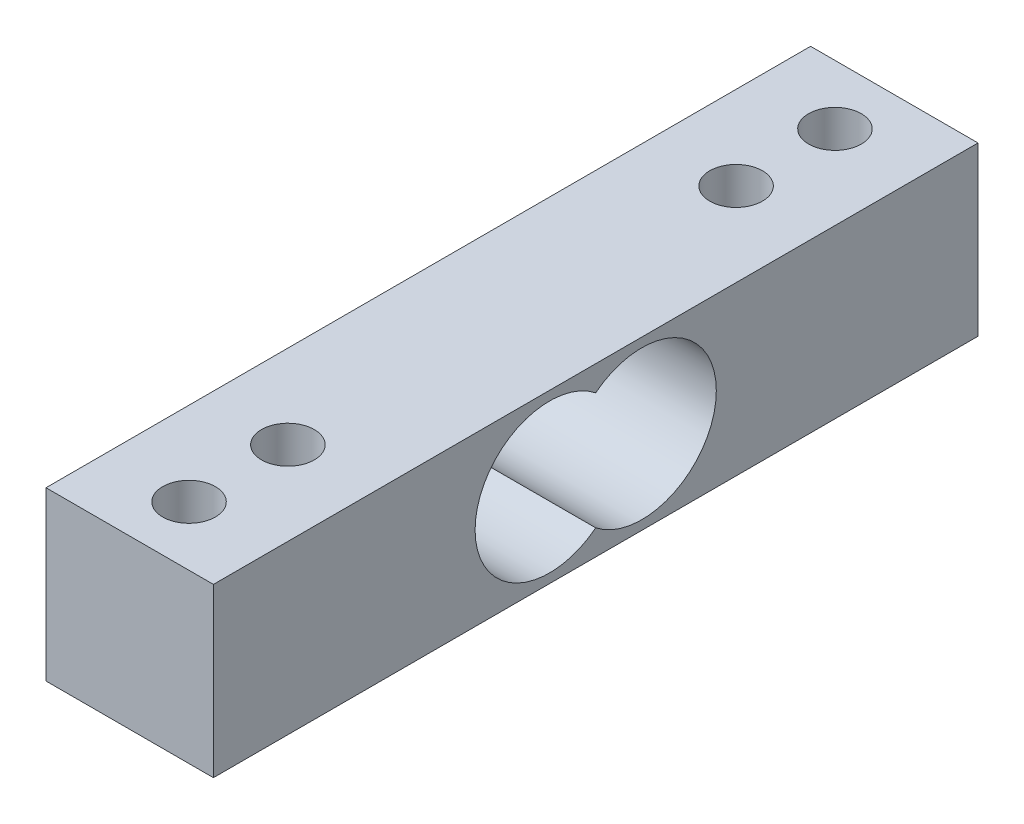
ISO-10303-21;
HEADER;
FILE_DESCRIPTION(('STEP AP214'),'2;1');
FILE_NAME('part.step','',(''),(''),'','','');
FILE_SCHEMA(('AUTOMOTIVE_DESIGN { 1 0 10303 214 1 1 1 1 }'));
ENDSEC;
DATA;
#1=APPLICATION_CONTEXT('core data for automotive mechanical design processes');
#2=APPLICATION_PROTOCOL_DEFINITION('international standard','automotive_design',2000,#1);
#3=PRODUCT_CONTEXT('',#1,'mechanical');
#4=PRODUCT('Part','Part','',(#3));
#5=PRODUCT_RELATED_PRODUCT_CATEGORY('part','',(#4));
#6=PRODUCT_DEFINITION_FORMATION('','',#4);
#7=PRODUCT_DEFINITION_CONTEXT('part definition',#1,'design');
#8=PRODUCT_DEFINITION('design','',#6,#7);
#9=PRODUCT_DEFINITION_SHAPE('','',#8);
#10=(LENGTH_UNIT() NAMED_UNIT(*) SI_UNIT(.MILLI.,.METRE.));
#11=(NAMED_UNIT(*) PLANE_ANGLE_UNIT() SI_UNIT($,.RADIAN.));
#12=(NAMED_UNIT(*) SI_UNIT($,.STERADIAN.) SOLID_ANGLE_UNIT());
#13=UNCERTAINTY_MEASURE_WITH_UNIT(LENGTH_MEASURE(1.E-05),#10,'distance_accuracy_value','');
#14=(GEOMETRIC_REPRESENTATION_CONTEXT(3) GLOBAL_UNCERTAINTY_ASSIGNED_CONTEXT((#13)) GLOBAL_UNIT_ASSIGNED_CONTEXT((#10,
#11,#12)) REPRESENTATION_CONTEXT('',''));
#15=CARTESIAN_POINT('',(0.,0.,0.));
#16=DIRECTION('',(0.,0.,1.));
#17=DIRECTION('',(1.,0.,0.));
#18=AXIS2_PLACEMENT_3D('',#15,#16,#17);
#19=CARTESIAN_POINT('',(-6.35,6.35,-29.));
#20=DIRECTION('',(-1.,0.,0.));
#21=DIRECTION('',(0.,-1.,0.));
#22=AXIS2_PLACEMENT_3D('',#19,#20,#21);
#23=PLANE('',#22);
#24=CARTESIAN_POINT('',(-6.35,0.,-3.5));
#25=DIRECTION('',(1.,0.,0.));
#26=DIRECTION('',(0.,0.,-1.));
#27=AXIS2_PLACEMENT_3D('',#24,#25,#26);
#28=CIRCLE('',#27,5.65);
#29=CARTESIAN_POINT('',(-6.34999999999999,-4.43536920672902,0.));
#30=VERTEX_POINT('',#29);
#31=CARTESIAN_POINT('',(-6.35,4.43536920672902,0.));
#32=VERTEX_POINT('',#31);
#33=EDGE_CURVE('E48',#30,#32,#28,.T.);
#34=ORIENTED_EDGE('',*,*,#33,.T.);
#35=CARTESIAN_POINT('',(-6.35,0.,3.5));
#36=DIRECTION('',(1.,0.,0.));
#37=DIRECTION('',(0.,0.,-1.));
#38=AXIS2_PLACEMENT_3D('',#35,#36,#37);
#39=CIRCLE('',#38,5.65);
#40=EDGE_CURVE('E88',#32,#30,#39,.T.);
#41=ORIENTED_EDGE('',*,*,#40,.T.);
#42=EDGE_LOOP('',(#34,#41));
#43=FACE_BOUND('',#42,.T.);
#44=DIRECTION('',(0.,-1.,0.));
#45=VECTOR('',#44,1.);
#46=CARTESIAN_POINT('',(-6.35,6.35,29.));
#47=LINE('',#46,#45);
#48=CARTESIAN_POINT('',(-6.35,6.35,29.));
#49=VERTEX_POINT('',#48);
#50=CARTESIAN_POINT('',(-6.34999999999999,-6.35,29.));
#51=VERTEX_POINT('',#50);
#52=EDGE_CURVE('E123',#49,#51,#47,.T.);
#53=ORIENTED_EDGE('',*,*,#52,.F.);
#54=DIRECTION('',(0.,0.,1.));
#55=VECTOR('',#54,1.);
#56=CARTESIAN_POINT('',(-6.35,6.35,-29.));
#57=LINE('',#56,#55);
#58=CARTESIAN_POINT('',(-6.35,6.35,-29.));
#59=VERTEX_POINT('',#58);
#60=EDGE_CURVE('E11',#59,#49,#57,.T.);
#61=ORIENTED_EDGE('',*,*,#60,.F.);
#62=DIRECTION('',(0.,-1.,0.));
#63=VECTOR('',#62,1.);
#64=CARTESIAN_POINT('',(-6.35,6.35,-29.));
#65=LINE('',#64,#63);
#66=CARTESIAN_POINT('',(-6.34999999999999,-6.35,-29.));
#67=VERTEX_POINT('',#66);
#68=EDGE_CURVE('E126',#59,#67,#65,.T.);
#69=ORIENTED_EDGE('',*,*,#68,.T.);
#70=DIRECTION('',(0.,0.,1.));
#71=VECTOR('',#70,1.);
#72=CARTESIAN_POINT('',(-6.34999999999999,-6.35,-29.));
#73=LINE('',#72,#71);
#74=EDGE_CURVE('E35',#67,#51,#73,.T.);
#75=ORIENTED_EDGE('',*,*,#74,.T.);
#76=EDGE_LOOP('',(#53,#61,#69,#75));
#77=FACE_BOUND('',#76,.T.);
#78=ADVANCED_FACE('F32',(#43,#77),#23,.T.);
#79=CARTESIAN_POINT('',(-6.35,6.35,-29.));
#80=DIRECTION('',(0.,1.,0.));
#81=DIRECTION('',(-1.,0.,0.));
#82=AXIS2_PLACEMENT_3D('',#79,#80,#81);
#83=PLANE('',#82);
#84=CARTESIAN_POINT('',(0.,6.35,24.5));
#85=DIRECTION('',(0.,1.,0.));
#86=DIRECTION('',(-1.,0.,0.));
#87=AXIS2_PLACEMENT_3D('',#84,#85,#86);
#88=CIRCLE('',#87,2.);
#89=CARTESIAN_POINT('',(-2.,6.35,24.5));
#90=VERTEX_POINT('',#89);
#91=EDGE_CURVE('E100',#90,#90,#88,.T.);
#92=ORIENTED_EDGE('',*,*,#91,.F.);
#93=EDGE_LOOP('',(#92));
#94=FACE_BOUND('',#93,.T.);
#95=CARTESIAN_POINT('',(0.,6.35,17.));
#96=DIRECTION('',(0.,1.,0.));
#97=DIRECTION('',(-1.,0.,0.));
#98=AXIS2_PLACEMENT_3D('',#95,#96,#97);
#99=CIRCLE('',#98,2.);
#100=CARTESIAN_POINT('',(-2.,6.35,17.));
#101=VERTEX_POINT('',#100);
#102=EDGE_CURVE('E105',#101,#101,#99,.T.);
#103=ORIENTED_EDGE('',*,*,#102,.F.);
#104=EDGE_LOOP('',(#103));
#105=FACE_BOUND('',#104,.T.);
#106=CARTESIAN_POINT('',(0.,6.35,-17.));
#107=DIRECTION('',(0.,1.,0.));
#108=DIRECTION('',(-1.,0.,0.));
#109=AXIS2_PLACEMENT_3D('',#106,#107,#108);
#110=CIRCLE('',#109,2.);
#111=CARTESIAN_POINT('',(-2.,6.35,-17.));
#112=VERTEX_POINT('',#111);
#113=EDGE_CURVE('E111',#112,#112,#110,.T.);
#114=ORIENTED_EDGE('',*,*,#113,.F.);
#115=EDGE_LOOP('',(#114));
#116=FACE_BOUND('',#115,.T.);
#117=CARTESIAN_POINT('',(0.,6.35,-24.5));
#118=DIRECTION('',(0.,1.,0.));
#119=DIRECTION('',(-1.,0.,0.));
#120=AXIS2_PLACEMENT_3D('',#117,#118,#119);
#121=CIRCLE('',#120,2.);
#122=CARTESIAN_POINT('',(-2.,6.35,-24.5));
#123=VERTEX_POINT('',#122);
#124=EDGE_CURVE('E117',#123,#123,#121,.T.);
#125=ORIENTED_EDGE('',*,*,#124,.F.);
#126=EDGE_LOOP('',(#125));
#127=FACE_BOUND('',#126,.T.);
#128=DIRECTION('',(-1.,0.,0.));
#129=VECTOR('',#128,1.);
#130=CARTESIAN_POINT('',(-6.35,6.35,29.));
#131=LINE('',#130,#129);
#132=CARTESIAN_POINT('',(6.35,6.35,29.));
#133=VERTEX_POINT('',#132);
#134=EDGE_CURVE('E130',#133,#49,#131,.T.);
#135=ORIENTED_EDGE('',*,*,#134,.F.);
#136=DIRECTION('',(0.,0.,1.));
#137=VECTOR('',#136,1.);
#138=CARTESIAN_POINT('',(6.35,6.35,-29.));
#139=LINE('',#138,#137);
#140=CARTESIAN_POINT('',(6.35,6.35,-29.));
#141=VERTEX_POINT('',#140);
#142=EDGE_CURVE('E40',#141,#133,#139,.T.);
#143=ORIENTED_EDGE('',*,*,#142,.F.);
#144=DIRECTION('',(-1.,0.,0.));
#145=VECTOR('',#144,1.);
#146=CARTESIAN_POINT('',(-6.35,6.35,-29.));
#147=LINE('',#146,#145);
#148=EDGE_CURVE('E136',#141,#59,#147,.T.);
#149=ORIENTED_EDGE('',*,*,#148,.T.);
#150=ORIENTED_EDGE('',*,*,#60,.T.);
#151=EDGE_LOOP('',(#135,#143,#149,#150));
#152=FACE_BOUND('',#151,.T.);
#153=ADVANCED_FACE('F161',(#94,#105,#116,#127,#152),#83,.T.);
#154=CARTESIAN_POINT('',(6.35,6.35,-29.));
#155=DIRECTION('',(1.,0.,0.));
#156=DIRECTION('',(0.,0.,-1.));
#157=AXIS2_PLACEMENT_3D('',#154,#155,#156);
#158=PLANE('',#157);
#159=CARTESIAN_POINT('',(6.35,0.,-3.5));
#160=DIRECTION('',(1.,0.,0.));
#161=DIRECTION('',(0.,0.,-1.));
#162=AXIS2_PLACEMENT_3D('',#159,#160,#161);
#163=CIRCLE('',#162,5.65);
#164=CARTESIAN_POINT('',(6.35,-4.43536920672902,0.));
#165=VERTEX_POINT('',#164);
#166=CARTESIAN_POINT('',(6.35,4.43536920672902,0.));
#167=VERTEX_POINT('',#166);
#168=EDGE_CURVE('E53',#165,#167,#163,.T.);
#169=ORIENTED_EDGE('',*,*,#168,.F.);
#170=CARTESIAN_POINT('',(6.35,0.,3.5));
#171=DIRECTION('',(1.,0.,0.));
#172=DIRECTION('',(0.,0.,-1.));
#173=AXIS2_PLACEMENT_3D('',#170,#171,#172);
#174=CIRCLE('',#173,5.65);
#175=EDGE_CURVE('E95',#167,#165,#174,.T.);
#176=ORIENTED_EDGE('',*,*,#175,.F.);
#177=EDGE_LOOP('',(#169,#176));
#178=FACE_BOUND('',#177,.T.);
#179=DIRECTION('',(0.,1.,0.));
#180=VECTOR('',#179,1.);
#181=CARTESIAN_POINT('',(6.35,6.35,29.));
#182=LINE('',#181,#180);
#183=CARTESIAN_POINT('',(6.35,-6.35,29.));
#184=VERTEX_POINT('',#183);
#185=EDGE_CURVE('E144',#184,#133,#182,.T.);
#186=ORIENTED_EDGE('',*,*,#185,.F.);
#187=DIRECTION('',(0.,0.,1.));
#188=VECTOR('',#187,1.);
#189=CARTESIAN_POINT('',(6.35,-6.35,-29.));
#190=LINE('',#189,#188);
#191=CARTESIAN_POINT('',(6.35,-6.35,-29.));
#192=VERTEX_POINT('',#191);
#193=EDGE_CURVE('E149',#192,#184,#190,.T.);
#194=ORIENTED_EDGE('',*,*,#193,.F.);
#195=DIRECTION('',(0.,1.,0.));
#196=VECTOR('',#195,1.);
#197=CARTESIAN_POINT('',(6.35,6.35,-29.));
#198=LINE('',#197,#196);
#199=EDGE_CURVE('E133',#192,#141,#198,.T.);
#200=ORIENTED_EDGE('',*,*,#199,.T.);
#201=ORIENTED_EDGE('',*,*,#142,.T.);
#202=EDGE_LOOP('',(#186,#194,#200,#201));
#203=FACE_BOUND('',#202,.T.);
#204=ADVANCED_FACE('F167',(#178,#203),#158,.T.);
#205=CARTESIAN_POINT('',(-6.34999999999999,-6.35,-29.));
#206=DIRECTION('',(0.,-1.,0.));
#207=DIRECTION('',(1.,0.,0.));
#208=AXIS2_PLACEMENT_3D('',#205,#206,#207);
#209=PLANE('',#208);
#210=CARTESIAN_POINT('',(0.,-6.35,24.5));
#211=DIRECTION('',(0.,1.,0.));
#212=DIRECTION('',(-1.,0.,0.));
#213=AXIS2_PLACEMENT_3D('',#210,#211,#212);
#214=CIRCLE('',#213,2.);
#215=CARTESIAN_POINT('',(-1.99999999999999,-6.35,24.5));
#216=VERTEX_POINT('',#215);
#217=EDGE_CURVE('E102',#216,#216,#214,.T.);
#218=ORIENTED_EDGE('',*,*,#217,.T.);
#219=EDGE_LOOP('',(#218));
#220=FACE_BOUND('',#219,.T.);
#221=CARTESIAN_POINT('',(0.,-6.35,17.));
#222=DIRECTION('',(0.,1.,0.));
#223=DIRECTION('',(-1.,0.,0.));
#224=AXIS2_PLACEMENT_3D('',#221,#222,#223);
#225=CIRCLE('',#224,2.);
#226=CARTESIAN_POINT('',(-1.99999999999999,-6.35,17.));
#227=VERTEX_POINT('',#226);
#228=EDGE_CURVE('E108',#227,#227,#225,.T.);
#229=ORIENTED_EDGE('',*,*,#228,.T.);
#230=EDGE_LOOP('',(#229));
#231=FACE_BOUND('',#230,.T.);
#232=CARTESIAN_POINT('',(0.,-6.35,-17.));
#233=DIRECTION('',(0.,1.,0.));
#234=DIRECTION('',(-1.,0.,0.));
#235=AXIS2_PLACEMENT_3D('',#232,#233,#234);
#236=CIRCLE('',#235,2.);
#237=CARTESIAN_POINT('',(-1.99999999999999,-6.35,-17.));
#238=VERTEX_POINT('',#237);
#239=EDGE_CURVE('E114',#238,#238,#236,.T.);
#240=ORIENTED_EDGE('',*,*,#239,.T.);
#241=EDGE_LOOP('',(#240));
#242=FACE_BOUND('',#241,.T.);
#243=CARTESIAN_POINT('',(0.,-6.35,-24.5));
#244=DIRECTION('',(0.,1.,0.));
#245=DIRECTION('',(-1.,0.,0.));
#246=AXIS2_PLACEMENT_3D('',#243,#244,#245);
#247=CIRCLE('',#246,2.);
#248=CARTESIAN_POINT('',(-1.99999999999999,-6.35,-24.5));
#249=VERTEX_POINT('',#248);
#250=EDGE_CURVE('E120',#249,#249,#247,.T.);
#251=ORIENTED_EDGE('',*,*,#250,.T.);
#252=EDGE_LOOP('',(#251));
#253=FACE_BOUND('',#252,.T.);
#254=DIRECTION('',(1.,0.,0.));
#255=VECTOR('',#254,1.);
#256=CARTESIAN_POINT('',(-6.34999999999999,-6.35,29.));
#257=LINE('',#256,#255);
#258=EDGE_CURVE('E141',#51,#184,#257,.T.);
#259=ORIENTED_EDGE('',*,*,#258,.F.);
#260=ORIENTED_EDGE('',*,*,#74,.F.);
#261=DIRECTION('',(1.,0.,0.));
#262=VECTOR('',#261,1.);
#263=CARTESIAN_POINT('',(-6.34999999999999,-6.35,-29.));
#264=LINE('',#263,#262);
#265=EDGE_CURVE('E129',#67,#192,#264,.T.);
#266=ORIENTED_EDGE('',*,*,#265,.T.);
#267=ORIENTED_EDGE('',*,*,#193,.T.);
#268=EDGE_LOOP('',(#259,#260,#266,#267));
#269=FACE_BOUND('',#268,.T.);
#270=ADVANCED_FACE('F156',(#220,#231,#242,#253,#269),#209,.T.);
#271=CARTESIAN_POINT('',(0.,0.,-29.));
#272=DIRECTION('',(0.,0.,1.));
#273=DIRECTION('',(1.,0.,0.));
#274=AXIS2_PLACEMENT_3D('',#271,#272,#273);
#275=PLANE('',#274);
#276=ORIENTED_EDGE('',*,*,#68,.F.);
#277=ORIENTED_EDGE('',*,*,#148,.F.);
#278=ORIENTED_EDGE('',*,*,#199,.F.);
#279=ORIENTED_EDGE('',*,*,#265,.F.);
#280=EDGE_LOOP('',(#276,#277,#278,#279));
#281=FACE_BOUND('',#280,.T.);
#282=ADVANCED_FACE('F164',(#281),#275,.F.);
#283=CARTESIAN_POINT('',(0.,0.,29.));
#284=DIRECTION('',(0.,0.,1.));
#285=DIRECTION('',(1.,0.,0.));
#286=AXIS2_PLACEMENT_3D('',#283,#284,#285);
#287=PLANE('',#286);
#288=ORIENTED_EDGE('',*,*,#52,.T.);
#289=ORIENTED_EDGE('',*,*,#258,.T.);
#290=ORIENTED_EDGE('',*,*,#185,.T.);
#291=ORIENTED_EDGE('',*,*,#134,.T.);
#292=EDGE_LOOP('',(#288,#289,#290,#291));
#293=FACE_BOUND('',#292,.T.);
#294=ADVANCED_FACE('F158',(#293),#287,.T.);
#295=CARTESIAN_POINT('',(0.,-6.35,-24.5));
#296=DIRECTION('',(0.,1.,0.));
#297=DIRECTION('',(-1.,0.,0.));
#298=AXIS2_PLACEMENT_3D('',#295,#296,#297);
#299=CYLINDRICAL_SURFACE('',#298,2.);
#300=ORIENTED_EDGE('',*,*,#250,.F.);
#301=EDGE_LOOP('',(#300));
#302=FACE_BOUND('',#301,.T.);
#303=ORIENTED_EDGE('',*,*,#124,.T.);
#304=EDGE_LOOP('',(#303));
#305=FACE_BOUND('',#304,.T.);
#306=ADVANCED_FACE('F205',(#302,#305),#299,.F.);
#307=CARTESIAN_POINT('',(0.,-6.35,-17.));
#308=DIRECTION('',(0.,1.,0.));
#309=DIRECTION('',(-1.,0.,0.));
#310=AXIS2_PLACEMENT_3D('',#307,#308,#309);
#311=CYLINDRICAL_SURFACE('',#310,2.);
#312=ORIENTED_EDGE('',*,*,#239,.F.);
#313=EDGE_LOOP('',(#312));
#314=FACE_BOUND('',#313,.T.);
#315=ORIENTED_EDGE('',*,*,#113,.T.);
#316=EDGE_LOOP('',(#315));
#317=FACE_BOUND('',#316,.T.);
#318=ADVANCED_FACE('F210',(#314,#317),#311,.F.);
#319=CARTESIAN_POINT('',(0.,-6.35,17.));
#320=DIRECTION('',(0.,1.,0.));
#321=DIRECTION('',(-1.,0.,0.));
#322=AXIS2_PLACEMENT_3D('',#319,#320,#321);
#323=CYLINDRICAL_SURFACE('',#322,2.);
#324=ORIENTED_EDGE('',*,*,#228,.F.);
#325=EDGE_LOOP('',(#324));
#326=FACE_BOUND('',#325,.T.);
#327=ORIENTED_EDGE('',*,*,#102,.T.);
#328=EDGE_LOOP('',(#327));
#329=FACE_BOUND('',#328,.T.);
#330=ADVANCED_FACE('F220',(#326,#329),#323,.F.);
#331=CARTESIAN_POINT('',(0.,-6.35,24.5));
#332=DIRECTION('',(0.,1.,0.));
#333=DIRECTION('',(-1.,0.,0.));
#334=AXIS2_PLACEMENT_3D('',#331,#332,#333);
#335=CYLINDRICAL_SURFACE('',#334,2.);
#336=ORIENTED_EDGE('',*,*,#217,.F.);
#337=EDGE_LOOP('',(#336));
#338=FACE_BOUND('',#337,.T.);
#339=ORIENTED_EDGE('',*,*,#91,.T.);
#340=EDGE_LOOP('',(#339));
#341=FACE_BOUND('',#340,.T.);
#342=ADVANCED_FACE('F229',(#338,#341),#335,.F.);
#343=CARTESIAN_POINT('',(-6.35,0.,-3.5));
#344=DIRECTION('',(1.,0.,0.));
#345=DIRECTION('',(0.,0.,-1.));
#346=AXIS2_PLACEMENT_3D('',#343,#344,#345);
#347=CYLINDRICAL_SURFACE('',#346,5.65);
#348=ORIENTED_EDGE('',*,*,#168,.T.);
#349=DIRECTION('',(1.,0.,0.));
#350=VECTOR('',#349,1.);
#351=CARTESIAN_POINT('',(-6.35,4.43536920672902,0.));
#352=LINE('',#351,#350);
#353=EDGE_CURVE('E81',#32,#167,#352,.T.);
#354=ORIENTED_EDGE('',*,*,#353,.F.);
#355=ORIENTED_EDGE('',*,*,#33,.F.);
#356=DIRECTION('',(1.,0.,0.));
#357=VECTOR('',#356,1.);
#358=CARTESIAN_POINT('',(-6.35,-4.43536920672902,0.));
#359=LINE('',#358,#357);
#360=EDGE_CURVE('E87',#30,#165,#359,.T.);
#361=ORIENTED_EDGE('',*,*,#360,.T.);
#362=EDGE_LOOP('',(#348,#354,#355,#361));
#363=FACE_BOUND('',#362,.T.);
#364=ADVANCED_FACE('F83',(#363),#347,.F.);
#365=CARTESIAN_POINT('',(-6.35,0.,3.5));
#366=DIRECTION('',(1.,0.,0.));
#367=DIRECTION('',(0.,0.,-1.));
#368=AXIS2_PLACEMENT_3D('',#365,#366,#367);
#369=CYLINDRICAL_SURFACE('',#368,5.65);
#370=ORIENTED_EDGE('',*,*,#175,.T.);
#371=ORIENTED_EDGE('',*,*,#360,.F.);
#372=ORIENTED_EDGE('',*,*,#40,.F.);
#373=ORIENTED_EDGE('',*,*,#353,.T.);
#374=EDGE_LOOP('',(#370,#371,#372,#373));
#375=FACE_BOUND('',#374,.T.);
#376=ADVANCED_FACE('F91',(#375),#369,.F.);
#377=CLOSED_SHELL('',(#78,#153,#204,#270,#282,#294,#306,#318,#330,#342,#364,#376));
#378=MANIFOLD_SOLID_BREP('B2',#377);
#379=ADVANCED_BREP_SHAPE_REPRESENTATION('',(#18,#378),#14);
#380=SHAPE_DEFINITION_REPRESENTATION(#9,#379);
ENDSEC;
END-ISO-10303-21;
